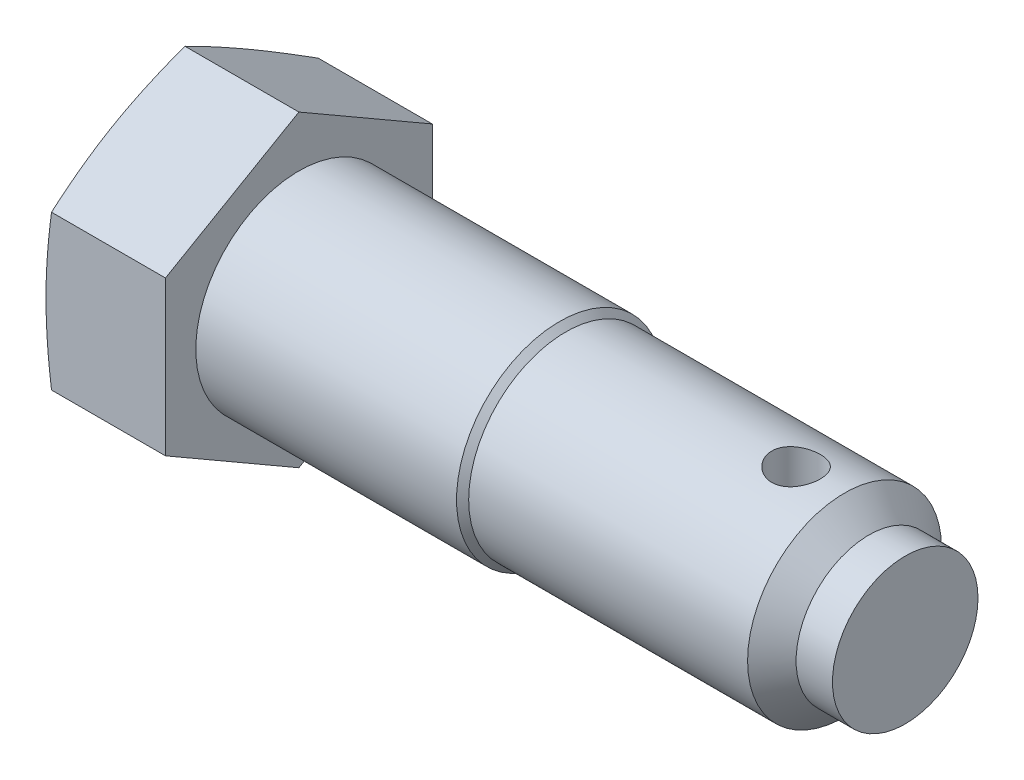
ISO-10303-21;
HEADER;
FILE_DESCRIPTION(('STEP AP214'),'2;1');
FILE_NAME('part.step','',(''),(''),'','','');
FILE_SCHEMA(('AUTOMOTIVE_DESIGN { 1 0 10303 214 1 1 1 1 }'));
ENDSEC;
DATA;
#1=APPLICATION_CONTEXT('core data for automotive mechanical design processes');
#2=APPLICATION_PROTOCOL_DEFINITION('international standard','automotive_design',2000,#1);
#3=PRODUCT_CONTEXT('',#1,'mechanical');
#4=PRODUCT('Part','Part','',(#3));
#5=PRODUCT_RELATED_PRODUCT_CATEGORY('part','',(#4));
#6=PRODUCT_DEFINITION_FORMATION('','',#4);
#7=PRODUCT_DEFINITION_CONTEXT('part definition',#1,'design');
#8=PRODUCT_DEFINITION('design','',#6,#7);
#9=PRODUCT_DEFINITION_SHAPE('','',#8);
#10=(LENGTH_UNIT() NAMED_UNIT(*) SI_UNIT(.MILLI.,.METRE.));
#11=(NAMED_UNIT(*) PLANE_ANGLE_UNIT() SI_UNIT($,.RADIAN.));
#12=(NAMED_UNIT(*) SI_UNIT($,.STERADIAN.) SOLID_ANGLE_UNIT());
#13=UNCERTAINTY_MEASURE_WITH_UNIT(LENGTH_MEASURE(1.E-05),#10,'distance_accuracy_value','');
#14=(GEOMETRIC_REPRESENTATION_CONTEXT(3) GLOBAL_UNCERTAINTY_ASSIGNED_CONTEXT((#13)) GLOBAL_UNIT_ASSIGNED_CONTEXT((#10,
#11,#12)) REPRESENTATION_CONTEXT('',''));
#15=CARTESIAN_POINT('',(0.,0.,0.));
#16=DIRECTION('',(0.,0.,1.));
#17=DIRECTION('',(1.,0.,0.));
#18=AXIS2_PLACEMENT_3D('',#15,#16,#17);
#19=CARTESIAN_POINT('',(0.,0.,0.));
#20=DIRECTION('',(1.,0.,0.));
#21=DIRECTION('',(0.,0.,-1.));
#22=AXIS2_PLACEMENT_3D('',#19,#20,#21);
#23=CYLINDRICAL_SURFACE('',#22,8.5);
#24=CARTESIAN_POINT('',(0.,0.,0.));
#25=DIRECTION('',(1.,0.,0.));
#26=DIRECTION('',(0.,0.,-1.));
#27=AXIS2_PLACEMENT_3D('',#24,#25,#26);
#28=CIRCLE('',#27,8.5);
#29=CARTESIAN_POINT('',(0.,0.,-8.5));
#30=VERTEX_POINT('',#29);
#31=EDGE_CURVE('E115',#30,#30,#28,.F.);
#32=ORIENTED_EDGE('',*,*,#31,.F.);
#33=EDGE_LOOP('',(#32));
#34=FACE_BOUND('',#33,.T.);
#35=CARTESIAN_POINT('',(21.5,0.,0.));
#36=DIRECTION('',(1.,0.,0.));
#37=DIRECTION('',(0.,0.,-1.));
#38=AXIS2_PLACEMENT_3D('',#35,#36,#37);
#39=CIRCLE('',#38,8.5);
#40=CARTESIAN_POINT('',(21.5,0.,-8.5));
#41=VERTEX_POINT('',#40);
#42=EDGE_CURVE('E11',#41,#41,#39,.T.);
#43=ORIENTED_EDGE('',*,*,#42,.F.);
#44=EDGE_LOOP('',(#43));
#45=FACE_BOUND('',#44,.T.);
#46=ADVANCED_FACE('F32',(#34,#45),#23,.T.);
#47=CARTESIAN_POINT('',(22.,0.,0.));
#48=DIRECTION('',(-1.,0.,0.));
#49=DIRECTION('',(0.,0.,1.));
#50=AXIS2_PLACEMENT_3D('',#47,#48,#49);
#51=CONICAL_SURFACE('',#50,8.,0.785398163397452);
#52=ORIENTED_EDGE('',*,*,#42,.T.);
#53=EDGE_LOOP('',(#52));
#54=FACE_BOUND('',#53,.T.);
#55=CARTESIAN_POINT('',(22.,0.,0.));
#56=DIRECTION('',(1.,0.,0.));
#57=DIRECTION('',(0.,0.,-1.));
#58=AXIS2_PLACEMENT_3D('',#55,#56,#57);
#59=CIRCLE('',#58,8.);
#60=CARTESIAN_POINT('',(22.,0.,-8.));
#61=VERTEX_POINT('',#60);
#62=EDGE_CURVE('E44',#61,#61,#59,.T.);
#63=ORIENTED_EDGE('',*,*,#62,.F.);
#64=EDGE_LOOP('',(#63));
#65=FACE_BOUND('',#64,.T.);
#66=ADVANCED_FACE('F209',(#54,#65),#51,.T.);
#67=CARTESIAN_POINT('',(0.,0.,0.));
#68=DIRECTION('',(1.,0.,0.));
#69=DIRECTION('',(0.,0.,-1.));
#70=AXIS2_PLACEMENT_3D('',#67,#68,#69);
#71=CYLINDRICAL_SURFACE('',#70,8.);
#72=CARTESIAN_POINT('',(41.,-7.74596669241484,2.));
#73=CARTESIAN_POINT('',(40.8895593992587,-7.74596880070288,1.99999686287446));
#74=CARTESIAN_POINT('',(40.7790840810572,-7.74835444811678,1.99082099639812));
#75=CARTESIAN_POINT('',(40.5613059374612,-7.75761489594051,1.95441850037104));
#76=CARTESIAN_POINT('',(40.4540049964255,-7.76449230897304,1.92718136539369));
#77=CARTESIAN_POINT('',(40.2457571694503,-7.7819097967692,1.85559295970564));
#78=CARTESIAN_POINT('',(40.1448022756914,-7.79244514152366,1.8112637822836));
#79=CARTESIAN_POINT('',(39.9517513179681,-7.81598553623007,1.70681691300911));
#80=CARTESIAN_POINT('',(39.8596556303358,-7.82899069102792,1.64669855084855));
#81=CARTESIAN_POINT('',(39.6849106837902,-7.856325730845,1.51096674184951));
#82=CARTESIAN_POINT('',(39.60248511972,-7.87067678098427,1.43506951016325));
#83=CARTESIAN_POINT('',(39.4513908845117,-7.89890300412235,1.27054565128054));
#84=CARTESIAN_POINT('',(39.3827234995026,-7.91277813253111,1.18191783534425));
#85=CARTESIAN_POINT('',(39.260179625895,-7.93872332416466,0.992916160863168));
#86=CARTESIAN_POINT('',(39.2065228894708,-7.95076549920474,0.892395660956099));
#87=CARTESIAN_POINT('',(39.1169522846775,-7.97144649540787,0.683410547434211));
#88=CARTESIAN_POINT('',(39.0810357984676,-7.98008581867476,0.574947108633554));
#89=CARTESIAN_POINT('',(39.0286817323371,-7.99283807078545,0.355487007003331));
#90=CARTESIAN_POINT('',(39.0118642845387,-7.99703915075452,0.244586175639183));
#91=CARTESIAN_POINT('',(38.9969932965796,-8.00074875285839,0.021463055410218));
#92=CARTESIAN_POINT('',(38.9989369822323,-8.00025796877364,-0.0907590356304527));
#93=CARTESIAN_POINT('',(39.0212598802001,-7.99470475962828,-0.310704494344772));
#94=CARTESIAN_POINT('',(39.0412290600431,-7.989744018727,-0.418472431202131));
#95=CARTESIAN_POINT('',(39.0983770160388,-7.97592669219884,-0.62907649482737));
#96=CARTESIAN_POINT('',(39.1355567083019,-7.96706989918753,-0.731912358740875));
#97=CARTESIAN_POINT('',(39.2264020565497,-7.94630007760717,-0.930813407003614));
#98=CARTESIAN_POINT('',(39.2802136357294,-7.93436015756043,-1.02680901953301));
#99=CARTESIAN_POINT('',(39.402684543293,-7.9087192304772,-1.20855124468098));
#100=CARTESIAN_POINT('',(39.4713464548485,-7.89501791721992,-1.29429607017101));
#101=CARTESIAN_POINT('',(39.6237669935859,-7.86690971015617,-1.45554807016992));
#102=CARTESIAN_POINT('',(39.7078839138782,-7.85249375620734,-1.5307153581504));
#103=CARTESIAN_POINT('',(39.8876799788322,-7.82492034813365,-1.66595275192604));
#104=CARTESIAN_POINT('',(39.9833596635928,-7.81176295284777,-1.72602215209203));
#105=CARTESIAN_POINT('',(40.1842320273192,-7.78816397465319,-1.8295762580452));
#106=CARTESIAN_POINT('',(40.2894685842506,-7.77773586980577,-1.87297913394099));
#107=CARTESIAN_POINT('',(40.5060683744612,-7.76094912111966,-1.94137124127268));
#108=CARTESIAN_POINT('',(40.6174302911865,-7.75458960648175,-1.96636441310582));
#109=CARTESIAN_POINT('',(40.8399676012185,-7.74684284831313,-1.99666371093214));
#110=CARTESIAN_POINT('',(40.9510702346637,-7.74532871274919,-2.0024723791357));
#111=CARTESIAN_POINT('',(41.1726575492625,-7.74709874784832,-1.99561359241244));
#112=CARTESIAN_POINT('',(41.283142286361,-7.75038247681013,-1.98294783827904));
#113=CARTESIAN_POINT('',(41.4984914119638,-7.76125665563649,-1.93994037115013));
#114=CARTESIAN_POINT('',(41.6034181812567,-7.768775761875,-1.9098912546254));
#115=CARTESIAN_POINT('',(41.8067451662814,-7.7872057461677,-1.8332944653365));
#116=CARTESIAN_POINT('',(41.9051446072443,-7.79811702598891,-1.78674483817004));
#117=CARTESIAN_POINT('',(42.0947530222939,-7.8223690967461,-1.67741653434925));
#118=CARTESIAN_POINT('',(42.1857830720345,-7.83575334885314,-1.6143374030685));
#119=CARTESIAN_POINT('',(42.3561506902411,-7.86333666457373,-1.47412058586891));
#120=CARTESIAN_POINT('',(42.4354863333201,-7.87753586182777,-1.39698058961088));
#121=CARTESIAN_POINT('',(42.5822488340568,-7.90557922425285,-1.22852544196945));
#122=CARTESIAN_POINT('',(42.6493280500391,-7.91940561649469,-1.13690390506319));
#123=CARTESIAN_POINT('',(42.767148693561,-7.94477773290988,-0.943405365389351));
#124=CARTESIAN_POINT('',(42.8178909732866,-7.95632357603169,-0.841528897915182));
#125=CARTESIAN_POINT('',(42.9011568276224,-7.97576092590651,-0.63111640346218));
#126=CARTESIAN_POINT('',(42.9338114275033,-7.98367864017925,-0.522634762055763));
#127=CARTESIAN_POINT('',(42.9803682676867,-7.99508234716634,-0.301499520637612));
#128=CARTESIAN_POINT('',(42.9942741269912,-7.99856919514738,-0.188846730082479));
#129=CARTESIAN_POINT('',(43.0027351791511,-8.00068338817612,0.0341670528866484));
#130=CARTESIAN_POINT('',(42.9978034181908,-7.99943957759977,0.144507653932046));
#131=CARTESIAN_POINT('',(42.9699043454113,-7.99251792914887,0.362734992829505));
#132=CARTESIAN_POINT('',(42.9469375699737,-7.98684022314338,0.47062180356186));
#133=CARTESIAN_POINT('',(42.8838955604583,-7.97170865707779,0.680342071289551));
#134=CARTESIAN_POINT('',(42.8439130933712,-7.96227529004785,0.782204989161728));
#135=CARTESIAN_POINT('',(42.7480588419609,-7.94062577827316,0.977834106083251));
#136=CARTESIAN_POINT('',(42.692185054659,-7.92840928277515,1.07159928253127));
#137=CARTESIAN_POINT('',(42.5645695320077,-7.90214499360574,1.25080385684661));
#138=CARTESIAN_POINT('',(42.4924797141923,-7.88806033883329,1.33598997659668));
#139=CARTESIAN_POINT('',(42.3351542960453,-7.8598129811438,1.49323004054701));
#140=CARTESIAN_POINT('',(42.2499153677777,-7.84565025934605,1.56528065015318));
#141=CARTESIAN_POINT('',(42.0667971716211,-7.81854951691005,1.69552405294367));
#142=CARTESIAN_POINT('',(41.9687117532695,-7.80563927346578,1.75343323883276));
#143=CARTESIAN_POINT('',(41.7638890202504,-7.78287910989656,1.85185379317095));
#144=CARTESIAN_POINT('',(41.6571580678123,-7.77302696466428,1.89237781950431));
#145=CARTESIAN_POINT('',(41.4588459763297,-7.75903817501475,1.94884505714201));
#146=CARTESIAN_POINT('',(41.3682136712277,-7.75417326006998,1.96798634119376));
#147=CARTESIAN_POINT('',(41.1850622620046,-7.74763677165241,1.99356458514354));
#148=CARTESIAN_POINT('',(41.0925433195112,-7.74596492578216,2.00000262874351));
#149=CARTESIAN_POINT('',(41.,-7.74596669241484,2.));
#150=B_SPLINE_CURVE_WITH_KNOTS('',3,(#72,#73,#74,#75,#76,#77,#78,#79,#80,#81,#82,#83,#84,#85,
#86,#87,#88,#89,#90,#91,#92,#93,#94,#95,#96,#97,#98,#99,#100,#101,#102,#103,#104,#105,#106,#107,
#108,#109,#110,#111,#112,#113,#114,#115,#116,#117,#118,#119,#120,#121,#122,#123,#124,#125,#126,
#127,#128,#129,#130,#131,#132,#133,#134,#135,#136,#137,#138,#139,#140,#141,#142,#143,#144,#145,
#146,#147,#148,#149),.UNSPECIFIED.,.T.,.F.,(4,2,2,2,2,2,2,2,2,2,2,2,2,2,2,2,2,2,2,2,2,2,2,2,2,2,
2,2,2,2,2,2,2,2,2,2,2,2,4),(0.,0.330981953388917,0.662156593142934,0.992904581732817,
1.32366661404383,1.6609916335438,1.99834817183894,2.34041197118337,2.68242527877674,
3.01751000796278,3.35254518932817,3.68014610151158,4.0077644537983,4.33834299403557,
4.66897908375132,5.00856373257531,5.34816424959843,5.68941145606724,6.03058560103639,
6.36274859809376,6.69488101747043,7.02157924007367,7.34831617137135,7.68146276687327,
8.01466415108037,8.35620264772256,8.69772332575644,9.03673658245545,9.37568439127232,
9.70546756901967,10.0352409390159,10.3632390124777,10.6912784459046,11.0271767726566,
11.3631602525241,11.7054118182895,12.0474137709606,12.3247826174463,12.6021278008238),.UNSPECIFIED.);
#151=CARTESIAN_POINT('',(41.,-7.74596669241484,2.));
#152=VERTEX_POINT('',#151);
#153=EDGE_CURVE('E35',#152,#152,#150,.T.);
#154=ORIENTED_EDGE('',*,*,#153,.F.);
#155=EDGE_LOOP('',(#154));
#156=FACE_BOUND('',#155,.T.);
#157=CARTESIAN_POINT('',(41.,7.74596669241484,2.));
#158=CARTESIAN_POINT('',(41.1104406007413,7.74596880070288,1.99999686287446));
#159=CARTESIAN_POINT('',(41.2209159189428,7.74835444811678,1.99082099639812));
#160=CARTESIAN_POINT('',(41.4386940625388,7.75761489594051,1.95441850037104));
#161=CARTESIAN_POINT('',(41.5459950035746,7.76449230897304,1.92718136539369));
#162=CARTESIAN_POINT('',(41.7542428305497,7.7819097967692,1.85559295970564));
#163=CARTESIAN_POINT('',(41.8551977243086,7.79244514152366,1.8112637822836));
#164=CARTESIAN_POINT('',(42.0482486820319,7.81598553623007,1.70681691300911));
#165=CARTESIAN_POINT('',(42.1403443696642,7.82899069102792,1.64669855084855));
#166=CARTESIAN_POINT('',(42.3150893162098,7.856325730845,1.51096674184951));
#167=CARTESIAN_POINT('',(42.39751488028,7.87067678098428,1.43506951016324));
#168=CARTESIAN_POINT('',(42.5486091154883,7.89890300412235,1.27054565128053));
#169=CARTESIAN_POINT('',(42.6172765004974,7.91277813253111,1.18191783534425));
#170=CARTESIAN_POINT('',(42.739820374105,7.93872332416466,0.992916160863167));
#171=CARTESIAN_POINT('',(42.7934771105292,7.95076549920474,0.892395660956099));
#172=CARTESIAN_POINT('',(42.8830477153225,7.97144649540787,0.683410547434211));
#173=CARTESIAN_POINT('',(42.9189642015324,7.98008581867476,0.574947108633554));
#174=CARTESIAN_POINT('',(42.9713182676629,7.99283807078545,0.355487007003331));
#175=CARTESIAN_POINT('',(42.9881357154613,7.99703915075452,0.244586175639183));
#176=CARTESIAN_POINT('',(43.0030067034205,8.00074875285839,0.021463055410218));
#177=CARTESIAN_POINT('',(43.0010630177677,8.00025796877364,-0.0907590356304527));
#178=CARTESIAN_POINT('',(42.9787401197999,7.99470475962828,-0.310704494344773));
#179=CARTESIAN_POINT('',(42.9587709399569,7.989744018727,-0.418472431202132));
#180=CARTESIAN_POINT('',(42.9016229839612,7.97592669219884,-0.629076494827372));
#181=CARTESIAN_POINT('',(42.8644432916981,7.96706989918753,-0.731912358740876));
#182=CARTESIAN_POINT('',(42.7735979434503,7.94630007760717,-0.930813407003614));
#183=CARTESIAN_POINT('',(42.7197863642706,7.93436015756043,-1.02680901953301));
#184=CARTESIAN_POINT('',(42.597315456707,7.9087192304772,-1.20855124468098));
#185=CARTESIAN_POINT('',(42.5286535451515,7.89501791721992,-1.29429607017101));
#186=CARTESIAN_POINT('',(42.3762330064141,7.86690971015617,-1.45554807016991));
#187=CARTESIAN_POINT('',(42.2921160861218,7.85249375620735,-1.5307153581504));
#188=CARTESIAN_POINT('',(42.1123200211678,7.82492034813365,-1.66595275192604));
#189=CARTESIAN_POINT('',(42.0166403364072,7.81176295284777,-1.72602215209203));
#190=CARTESIAN_POINT('',(41.8157679726808,7.78816397465319,-1.82957625804519));
#191=CARTESIAN_POINT('',(41.7105314157495,7.77773586980577,-1.87297913394098));
#192=CARTESIAN_POINT('',(41.4939316255388,7.76094912111966,-1.94137124127268));
#193=CARTESIAN_POINT('',(41.3825697088135,7.75458960648175,-1.96636441310582));
#194=CARTESIAN_POINT('',(41.1600323987815,7.74684284831313,-1.99666371093214));
#195=CARTESIAN_POINT('',(41.0489297653363,7.74532871274919,-2.0024723791357));
#196=CARTESIAN_POINT('',(40.8273424507375,7.74709874784832,-1.99561359241244));
#197=CARTESIAN_POINT('',(40.716857713639,7.75038247681013,-1.98294783827904));
#198=CARTESIAN_POINT('',(40.5015085880362,7.76125665563649,-1.93994037115013));
#199=CARTESIAN_POINT('',(40.3965818187433,7.768775761875,-1.9098912546254));
#200=CARTESIAN_POINT('',(40.1932548337187,7.7872057461677,-1.8332944653365));
#201=CARTESIAN_POINT('',(40.0948553927557,7.79811702598891,-1.78674483817004));
#202=CARTESIAN_POINT('',(39.9052469777061,7.8223690967461,-1.67741653434925));
#203=CARTESIAN_POINT('',(39.8142169279655,7.83575334885314,-1.6143374030685));
#204=CARTESIAN_POINT('',(39.6438493097589,7.86333666457373,-1.47412058586891));
#205=CARTESIAN_POINT('',(39.5645136666799,7.87753586182777,-1.39698058961088));
#206=CARTESIAN_POINT('',(39.4177511659432,7.90557922425285,-1.22852544196945));
#207=CARTESIAN_POINT('',(39.350671949961,7.91940561649469,-1.13690390506319));
#208=CARTESIAN_POINT('',(39.232851306439,7.94477773290988,-0.943405365389356));
#209=CARTESIAN_POINT('',(39.1821090267134,7.95632357603169,-0.841528897915184));
#210=CARTESIAN_POINT('',(39.0988431723777,7.97576092590651,-0.63111640346218));
#211=CARTESIAN_POINT('',(39.0661885724968,7.98367864017925,-0.522634762055764));
#212=CARTESIAN_POINT('',(39.0196317323133,7.99508234716634,-0.301499520637613));
#213=CARTESIAN_POINT('',(39.0057258730088,7.99856919514738,-0.18884673008248));
#214=CARTESIAN_POINT('',(38.9972648208489,8.00068338817612,0.0341670528866484));
#215=CARTESIAN_POINT('',(39.0021965818092,7.99943957759977,0.144507653932046));
#216=CARTESIAN_POINT('',(39.0300956545887,7.99251792914887,0.362734992829505));
#217=CARTESIAN_POINT('',(39.0530624300263,7.98684022314338,0.47062180356186));
#218=CARTESIAN_POINT('',(39.1161044395417,7.97170865707779,0.680342071289551));
#219=CARTESIAN_POINT('',(39.1560869066288,7.96227529004785,0.782204989161728));
#220=CARTESIAN_POINT('',(39.2519411580391,7.94062577827316,0.977834106083251));
#221=CARTESIAN_POINT('',(39.307814945341,7.92840928277515,1.07159928253127));
#222=CARTESIAN_POINT('',(39.4354304679923,7.90214499360574,1.25080385684661));
#223=CARTESIAN_POINT('',(39.5075202858077,7.88806033883329,1.33598997659668));
#224=CARTESIAN_POINT('',(39.6648457039547,7.8598129811438,1.49323004054701));
#225=CARTESIAN_POINT('',(39.7500846322223,7.84565025934605,1.56528065015318));
#226=CARTESIAN_POINT('',(39.9332028283789,7.81854951691005,1.69552405294367));
#227=CARTESIAN_POINT('',(40.0312882467305,7.80563927346578,1.75343323883276));
#228=CARTESIAN_POINT('',(40.2361109797496,7.78287910989656,1.85185379317095));
#229=CARTESIAN_POINT('',(40.3428419321877,7.77302696466428,1.89237781950431));
#230=CARTESIAN_POINT('',(40.5411540236703,7.75903817501475,1.94884505714201));
#231=CARTESIAN_POINT('',(40.6317863287723,7.75417326006998,1.96798634119376));
#232=CARTESIAN_POINT('',(40.8149377379954,7.74763677165241,1.99356458514354));
#233=CARTESIAN_POINT('',(40.9074566804888,7.74596492578216,2.00000262874351));
#234=CARTESIAN_POINT('',(41.,7.74596669241484,2.));
#235=B_SPLINE_CURVE_WITH_KNOTS('',3,(#157,#158,#159,#160,#161,#162,#163,#164,#165,#166,#167,
#168,#169,#170,#171,#172,#173,#174,#175,#176,#177,#178,#179,#180,#181,#182,#183,#184,#185,#186,
#187,#188,#189,#190,#191,#192,#193,#194,#195,#196,#197,#198,#199,#200,#201,#202,#203,#204,#205,
#206,#207,#208,#209,#210,#211,#212,#213,#214,#215,#216,#217,#218,#219,#220,#221,#222,#223,#224,
#225,#226,#227,#228,#229,#230,#231,#232,#233,#234),.UNSPECIFIED.,.T.,.F.,(4,2,2,2,2,2,2,2,2,2,2,
2,2,2,2,2,2,2,2,2,2,2,2,2,2,2,2,2,2,2,2,2,2,2,2,2,2,2,4),(0.,0.330981953388917,
0.662156593142934,0.992904581732817,1.32366661404383,1.66099163354382,1.99834817183894,
2.34041197118337,2.68242527877674,3.01751000796278,3.35254518932817,3.68014610151158,
4.0077644537983,4.33834299403557,4.66897908375132,5.0085637325753,5.34816424959843,
5.68941145606723,6.03058560103639,6.36274859809376,6.69488101747044,7.02157924007367,
7.34831617137135,7.68146276687327,8.01466415108037,8.35620264772256,8.69772332575644,
9.03673658245545,9.37568439127232,9.70546756901967,10.0352409390159,10.3632390124777,
10.6912784459046,11.0271767726566,11.3631602525241,11.7054118182895,12.0474137709606,
12.3247826174463,12.6021278008238),.UNSPECIFIED.);
#236=CARTESIAN_POINT('',(41.,7.74596669241484,2.));
#237=VERTEX_POINT('',#236);
#238=EDGE_CURVE('E133',#237,#237,#235,.T.);
#239=ORIENTED_EDGE('',*,*,#238,.F.);
#240=EDGE_LOOP('',(#239));
#241=FACE_BOUND('',#240,.T.);
#242=ORIENTED_EDGE('',*,*,#62,.T.);
#243=EDGE_LOOP('',(#242));
#244=FACE_BOUND('',#243,.T.);
#245=CARTESIAN_POINT('',(45.,0.,0.));
#246=DIRECTION('',(1.,0.,0.));
#247=DIRECTION('',(0.,0.,-1.));
#248=AXIS2_PLACEMENT_3D('',#245,#246,#247);
#249=CIRCLE('',#248,8.);
#250=CARTESIAN_POINT('',(45.,0.,-8.));
#251=VERTEX_POINT('',#250);
#252=EDGE_CURVE('E129',#251,#251,#249,.T.);
#253=ORIENTED_EDGE('',*,*,#252,.F.);
#254=EDGE_LOOP('',(#253));
#255=FACE_BOUND('',#254,.T.);
#256=ADVANCED_FACE('F137',(#156,#241,#244,#255),#71,.T.);
#257=CARTESIAN_POINT('',(47.,0.,0.));
#258=DIRECTION('',(-1.,0.,0.));
#259=DIRECTION('',(0.,0.,1.));
#260=AXIS2_PLACEMENT_3D('',#257,#258,#259);
#261=CONICAL_SURFACE('',#260,6.00000000000001,0.78539816339745);
#262=ORIENTED_EDGE('',*,*,#252,.T.);
#263=EDGE_LOOP('',(#262));
#264=FACE_BOUND('',#263,.T.);
#265=CARTESIAN_POINT('',(47.,0.,0.));
#266=DIRECTION('',(1.,0.,0.));
#267=DIRECTION('',(0.,0.,-1.));
#268=AXIS2_PLACEMENT_3D('',#265,#266,#267);
#269=CIRCLE('',#268,6.00000000000001);
#270=CARTESIAN_POINT('',(47.,0.,-6.00000000000001));
#271=VERTEX_POINT('',#270);
#272=EDGE_CURVE('E126',#271,#271,#269,.T.);
#273=ORIENTED_EDGE('',*,*,#272,.F.);
#274=EDGE_LOOP('',(#273));
#275=FACE_BOUND('',#274,.T.);
#276=ADVANCED_FACE('F202',(#264,#275),#261,.T.);
#277=CARTESIAN_POINT('',(0.,0.,0.));
#278=DIRECTION('',(1.,0.,0.));
#279=DIRECTION('',(0.,0.,-1.));
#280=AXIS2_PLACEMENT_3D('',#277,#278,#279);
#281=CYLINDRICAL_SURFACE('',#280,6.00000000000001);
#282=ORIENTED_EDGE('',*,*,#272,.T.);
#283=EDGE_LOOP('',(#282));
#284=FACE_BOUND('',#283,.T.);
#285=CARTESIAN_POINT('',(50.,0.,0.));
#286=DIRECTION('',(1.,0.,0.));
#287=DIRECTION('',(0.,0.,-1.));
#288=AXIS2_PLACEMENT_3D('',#285,#286,#287);
#289=CIRCLE('',#288,6.00000000000001);
#290=CARTESIAN_POINT('',(50.,0.,-6.00000000000001));
#291=VERTEX_POINT('',#290);
#292=EDGE_CURVE('E123',#291,#291,#289,.T.);
#293=ORIENTED_EDGE('',*,*,#292,.F.);
#294=EDGE_LOOP('',(#293));
#295=FACE_BOUND('',#294,.T.);
#296=ADVANCED_FACE('F199',(#284,#295),#281,.T.);
#297=CARTESIAN_POINT('',(50.,6.00000000000001,0.));
#298=DIRECTION('',(1.,0.,0.));
#299=DIRECTION('',(0.,0.,-1.));
#300=AXIS2_PLACEMENT_3D('',#297,#298,#299);
#301=PLANE('',#300);
#302=ORIENTED_EDGE('',*,*,#292,.T.);
#303=EDGE_LOOP('',(#302));
#304=FACE_BOUND('',#303,.T.);
#305=ADVANCED_FACE('F196',(#304),#301,.T.);
#306=CARTESIAN_POINT('',(-10.,6.35085296108589,11.));
#307=DIRECTION('',(0.,-0.866025403784439,-0.5));
#308=DIRECTION('',(0.,0.5,-0.866025403784439));
#309=AXIS2_PLACEMENT_3D('',#306,#307,#308);
#310=PLANE('',#309);
#311=DIRECTION('',(1.,0.,0.));
#312=VECTOR('',#311,1.);
#313=CARTESIAN_POINT('',(-10.,12.7017059221718,0.));
#314=LINE('',#313,#312);
#315=CARTESIAN_POINT('',(-9.39665721656171,12.7017059221718,0.));
#316=VERTEX_POINT('',#315);
#317=CARTESIAN_POINT('',(0.,12.7017059221718,0.));
#318=VERTEX_POINT('',#317);
#319=EDGE_CURVE('E113',#316,#318,#314,.T.);
#320=ORIENTED_EDGE('',*,*,#319,.F.);
#321=CARTESIAN_POINT('',(-9.39662627603213,12.7018213922256,-0.000199999999997409));
#322=CARTESIAN_POINT('',(-9.46732508481653,12.4380768419232,0.45661896134321));
#323=CARTESIAN_POINT('',(-9.53150785884367,12.1738541031355,0.914266169438542));
#324=CARTESIAN_POINT('',(-9.64427088043107,11.644475533245,1.83117674892698));
#325=CARTESIAN_POINT('',(-9.69284479100576,11.3793193672375,2.29044070039205));
#326=CARTESIAN_POINT('',(-9.77155445851667,10.8496815308214,3.2078003426756));
#327=CARTESIAN_POINT('',(-9.80178407701208,10.5852034415666,3.66588983075379));
#328=CARTESIAN_POINT('',(-9.84231889252227,10.0559099986362,4.58265296602219));
#329=CARTESIAN_POINT('',(-9.85262794416288,9.79109472013253,5.0413264830111));
#330=CARTESIAN_POINT('',(-9.85262794416288,9.26146416312513,5.9586735169889));
#331=CARTESIAN_POINT('',(-9.84231889252227,8.99664888462144,6.4173470339778));
#332=CARTESIAN_POINT('',(-9.80178407701208,8.4673554416911,7.3341101692462));
#333=CARTESIAN_POINT('',(-9.77155445851667,8.20287735243622,7.7921996573244));
#334=CARTESIAN_POINT('',(-9.69284479100576,7.67323951602012,8.70955929960795));
#335=CARTESIAN_POINT('',(-9.64427088043107,7.40808335001267,9.16882325107301));
#336=CARTESIAN_POINT('',(-9.53150785884367,6.8787047801222,10.0857338305615));
#337=CARTESIAN_POINT('',(-9.46732508481653,6.61448204133448,10.5433810386568));
#338=CARTESIAN_POINT('',(-9.39662627603213,6.35073749103205,11.0002));
#339=B_SPLINE_CURVE_WITH_KNOTS('',3,(#321,#322,#323,#324,#325,#326,#327,#328,#329,#330,#331,
#332,#333,#334,#335,#336,#337,#338),.UNSPECIFIED.,.F.,.F.,(4,2,2,2,2,2,2,2,4),(0.,
1.59670121511687,3.19404985254325,4.78315492460559,6.37195247434001,7.96075002407443,
9.54985509613678,11.1472037335631,12.74390494868),.UNSPECIFIED.);
#340=CARTESIAN_POINT('',(-9.39665721656171,6.3508529610859,11.));
#341=VERTEX_POINT('',#340);
#342=EDGE_CURVE('E95',#316,#341,#339,.T.);
#343=ORIENTED_EDGE('',*,*,#342,.T.);
#344=DIRECTION('',(1.,0.,0.));
#345=VECTOR('',#344,1.);
#346=CARTESIAN_POINT('',(-10.,6.35085296108589,11.));
#347=LINE('',#346,#345);
#348=CARTESIAN_POINT('',(0.,6.35085296108589,11.));
#349=VERTEX_POINT('',#348);
#350=EDGE_CURVE('E60',#341,#349,#347,.T.);
#351=ORIENTED_EDGE('',*,*,#350,.T.);
#352=DIRECTION('',(0.,0.5,-0.866025403784439));
#353=VECTOR('',#352,1.);
#354=CARTESIAN_POINT('',(0.,6.35085296108589,11.));
#355=LINE('',#354,#353);
#356=EDGE_CURVE('E232',#349,#318,#355,.T.);
#357=ORIENTED_EDGE('',*,*,#356,.T.);
#358=EDGE_LOOP('',(#320,#343,#351,#357));
#359=FACE_BOUND('',#358,.T.);
#360=ADVANCED_FACE('F191',(#359),#310,.F.);
#361=CARTESIAN_POINT('',(-10.,12.7017059221718,0.));
#362=DIRECTION('',(0.,-0.866025403784439,0.5));
#363=DIRECTION('',(0.,-0.5,-0.866025403784439));
#364=AXIS2_PLACEMENT_3D('',#361,#362,#363);
#365=PLANE('',#364);
#366=DIRECTION('',(1.,0.,0.));
#367=VECTOR('',#366,1.);
#368=CARTESIAN_POINT('',(-10.,6.35085296108589,-11.));
#369=LINE('',#368,#367);
#370=CARTESIAN_POINT('',(-9.39665721656171,6.35085296108589,-11.));
#371=VERTEX_POINT('',#370);
#372=CARTESIAN_POINT('',(0.,6.35085296108589,-11.));
#373=VERTEX_POINT('',#372);
#374=EDGE_CURVE('E104',#371,#373,#369,.T.);
#375=ORIENTED_EDGE('',*,*,#374,.F.);
#376=CARTESIAN_POINT('',(-9.39662627603213,6.35073749103205,-11.0002));
#377=CARTESIAN_POINT('',(-9.46732508481653,6.61448204133447,-10.5433810386568));
#378=CARTESIAN_POINT('',(-9.53150785884367,6.8787047801222,-10.0857338305615));
#379=CARTESIAN_POINT('',(-9.64427088043107,7.40808335001266,-9.16882325107302));
#380=CARTESIAN_POINT('',(-9.69284479100576,7.67323951602011,-8.70955929960795));
#381=CARTESIAN_POINT('',(-9.77155445851667,8.20287735243622,-7.7921996573244));
#382=CARTESIAN_POINT('',(-9.80178407701208,8.4673554416911,-7.33411016924621));
#383=CARTESIAN_POINT('',(-9.84231889252227,8.99664888462144,-6.4173470339778));
#384=CARTESIAN_POINT('',(-9.85262794416289,9.26146416312513,-5.9586735169889));
#385=CARTESIAN_POINT('',(-9.85262794416289,9.79109472013252,-5.0413264830111));
#386=CARTESIAN_POINT('',(-9.84231889252227,10.0559099986362,-4.58265296602219));
#387=CARTESIAN_POINT('',(-9.80178407701208,10.5852034415666,-3.66588983075379));
#388=CARTESIAN_POINT('',(-9.77155445851667,10.8496815308214,-3.2078003426756));
#389=CARTESIAN_POINT('',(-9.69284479100576,11.3793193672375,-2.29044070039205));
#390=CARTESIAN_POINT('',(-9.64427088043107,11.644475533245,-1.83117674892698));
#391=CARTESIAN_POINT('',(-9.53150785884367,12.1738541031355,-0.914266169438537));
#392=CARTESIAN_POINT('',(-9.46732508481653,12.4380768419232,-0.456618961343205));
#393=CARTESIAN_POINT('',(-9.39662627603213,12.7018213922256,0.000200000000003999));
#394=B_SPLINE_CURVE_WITH_KNOTS('',3,(#376,#377,#378,#379,#380,#381,#382,#383,#384,#385,#386,
#387,#388,#389,#390,#391,#392,#393),.UNSPECIFIED.,.F.,.F.,(4,2,2,2,2,2,2,2,4),(0.,
1.59670121511688,3.19404985254326,4.7831549246056,6.37195247434002,7.96075002407444,
9.54985509613679,11.1472037335632,12.74390494868),.UNSPECIFIED.);
#395=EDGE_CURVE('E90',#371,#316,#394,.T.);
#396=ORIENTED_EDGE('',*,*,#395,.T.);
#397=ORIENTED_EDGE('',*,*,#319,.T.);
#398=DIRECTION('',(0.,-0.5,-0.866025403784439));
#399=VECTOR('',#398,1.);
#400=CARTESIAN_POINT('',(0.,12.7017059221718,0.));
#401=LINE('',#400,#399);
#402=EDGE_CURVE('E111',#318,#373,#401,.T.);
#403=ORIENTED_EDGE('',*,*,#402,.T.);
#404=EDGE_LOOP('',(#375,#396,#397,#403));
#405=FACE_BOUND('',#404,.T.);
#406=ADVANCED_FACE('F109',(#405),#365,.F.);
#407=CARTESIAN_POINT('',(-10.,6.35085296108589,-11.));
#408=DIRECTION('',(0.,0.,1.));
#409=DIRECTION('',(1.,0.,0.));
#410=AXIS2_PLACEMENT_3D('',#407,#408,#409);
#411=PLANE('',#410);
#412=DIRECTION('',(1.,0.,0.));
#413=VECTOR('',#412,1.);
#414=CARTESIAN_POINT('',(-10.,-6.35085296108588,-11.));
#415=LINE('',#414,#413);
#416=CARTESIAN_POINT('',(-9.39665721656171,-6.35085296108588,-11.));
#417=VERTEX_POINT('',#416);
#418=CARTESIAN_POINT('',(0.,-6.35085296108588,-11.));
#419=VERTEX_POINT('',#418);
#420=EDGE_CURVE('E106',#417,#419,#415,.T.);
#421=ORIENTED_EDGE('',*,*,#420,.F.);
#422=CARTESIAN_POINT('',(-7.42388137262567,-16.7801175951475,-11.));
#423=CARTESIAN_POINT('',(-7.5356309599887,-16.2813050169155,-11.));
#424=CARTESIAN_POINT('',(-7.64601044346641,-15.7821798837228,-11.));
#425=CARTESIAN_POINT('',(-7.86328967734055,-14.7831510497652,-11.));
#426=CARTESIAN_POINT('',(-7.97018927681949,-14.2832473162161,-11.));
#427=CARTESIAN_POINT('',(-8.17986278992948,-13.2820573632576,-11.));
#428=CARTESIAN_POINT('',(-8.28263252908443,-12.7807702664818,-11.));
#429=CARTESIAN_POINT('',(-8.48293380894406,-11.7771512064843,-11.));
#430=CARTESIAN_POINT('',(-8.58046539407493,-11.2748192521619,-11.));
#431=CARTESIAN_POINT('',(-8.76828812506116,-10.2729548841119,-11.));
#432=CARTESIAN_POINT('',(-8.85863093050103,-9.77343220311056,-11.));
#433=CARTESIAN_POINT('',(-9.03140930348365,-8.7730102974347,-11.));
#434=CARTESIAN_POINT('',(-9.11384484158803,-8.27211106764249,-11.));
#435=CARTESIAN_POINT('',(-9.26894465465913,-7.26886039941843,-11.));
#436=CARTESIAN_POINT('',(-9.34161029066016,-6.76650917324339,-11.));
#437=CARTESIAN_POINT('',(-9.47502654326464,-5.76020882790563,-11.));
#438=CARTESIAN_POINT('',(-9.53577714954705,-5.25625970735916,-11.));
#439=CARTESIAN_POINT('',(-9.64363887592661,-4.24108542573291,-11.));
#440=CARTESIAN_POINT('',(-9.6905870438235,-3.72984268995295,-11.));
#441=CARTESIAN_POINT('',(-9.76760233141287,-2.70607634125081,-11.));
#442=CARTESIAN_POINT('',(-9.79766983825824,-2.1935527579753,-11.));
#443=CARTESIAN_POINT('',(-9.83916993693317,-1.16796788455669,-11.));
#444=CARTESIAN_POINT('',(-9.85061093202421,-0.654906941437574,-11.));
#445=CARTESIAN_POINT('',(-9.85415510051156,0.371282758987295,-11.));
#446=CARTESIAN_POINT('',(-9.84625828682822,0.884411516247514,-11.));
#447=CARTESIAN_POINT('',(-9.81157079469443,1.91188968945078,-11.));
#448=CARTESIAN_POINT('',(-9.78471134637838,2.42623673636404,-11.));
#449=CARTESIAN_POINT('',(-9.71362957984439,3.45371853578703,-11.));
#450=CARTESIAN_POINT('',(-9.66940687871218,3.96685326131018,-11.));
#451=CARTESIAN_POINT('',(-9.56582738852392,4.99190696444284,-11.));
#452=CARTESIAN_POINT('',(-9.50646075887166,5.50382493225285,-11.));
#453=CARTESIAN_POINT('',(-9.37505758959837,6.52601412270777,-11.));
#454=CARTESIAN_POINT('',(-9.30302101105935,7.0362853402895,-11.));
#455=CARTESIAN_POINT('',(-9.1536423793593,8.02181092851998,-11.));
#456=CARTESIAN_POINT('',(-9.07695856740143,8.49716608482734,-11.));
#457=CARTESIAN_POINT('',(-8.91616092195143,9.44662421093953,-11.));
#458=CARTESIAN_POINT('',(-8.83204688601822,9.92072714626415,-11.));
#459=CARTESIAN_POINT('',(-8.65774536703929,10.8678590126662,-11.));
#460=CARTESIAN_POINT('',(-8.56755727388029,11.3408878309054,-11.));
#461=CARTESIAN_POINT('',(-8.38222711433411,12.2859660191292,-11.));
#462=CARTESIAN_POINT('',(-8.28708509272075,12.758015397926,-11.));
#463=CARTESIAN_POINT('',(-8.09271933636531,13.7013870399982,-11.));
#464=CARTESIAN_POINT('',(-7.99349464263292,14.1727091051464,-11.));
#465=CARTESIAN_POINT('',(-7.79169487217196,15.1146364979406,-11.));
#466=CARTESIAN_POINT('',(-7.68911977600635,15.5852418214117,-11.));
#467=CARTESIAN_POINT('',(-7.37727307026139,16.9960797223851,-11.));
#468=CARTESIAN_POINT('',(-7.16386672641428,17.9353980180346,-11.));
#469=CARTESIAN_POINT('',(-6.73150792694893,19.8029725067641,-11.));
#470=CARTESIAN_POINT('',(-6.51263107785774,20.7312463182368,-11.));
#471=CARTESIAN_POINT('',(-6.06940222240138,22.5865014284903,-11.));
#472=CARTESIAN_POINT('',(-5.84505011643868,23.5134827034346,-11.));
#473=CARTESIAN_POINT('',(-5.39256994502507,25.365312037806,-11.));
#474=CARTESIAN_POINT('',(-5.16444686797217,26.2901613185028,-11.));
#475=CARTESIAN_POINT('',(-4.81995910729176,27.6768462370108,-11.));
#476=CARTESIAN_POINT('',(-4.70474786579954,28.1389689559575,-11.));
#477=CARTESIAN_POINT('',(-4.47364517344672,29.0630437745837,-11.));
#478=CARTESIAN_POINT('',(-4.35775372331801,29.5249958744463,-11.));
#479=CARTESIAN_POINT('',(-4.24156638787032,29.9868735377545,-11.));
#480=B_SPLINE_CURVE_WITH_KNOTS('',3,(#422,#423,#424,#425,#426,#427,#428,#429,#430,#431,#432,
#433,#434,#435,#436,#437,#438,#439,#440,#441,#442,#443,#444,#445,#446,#447,#448,#449,#450,#451,
#452,#453,#454,#455,#456,#457,#458,#459,#460,#461,#462,#463,#464,#465,#466,#467,#468,#469,#470,
#471,#472,#473,#474,#475,#476,#477,#478,#479),.UNSPECIFIED.,.F.,.F.,(4,2,2,2,2,2,2,2,2,2,2,2,2,
2,2,2,2,2,2,2,2,2,2,2,2,2,2,2,4),(0.,1.53353736493476,3.06714114878295,4.60225799339556,
6.13736181621159,7.66019072915064,9.18302531128823,10.7056475287163,12.2282710650634,
13.7682086142797,15.3081108440488,16.8473181616043,18.3865244507551,19.9313416898898,
21.4761929990113,23.0220507283824,24.5679132062104,26.0123458687951,27.4568178979955,
28.9014352353059,30.3460395183657,31.7909850876987,33.2359390412405,36.1256514737327,
38.9868196418528,41.8480398948312,44.7057378419322,46.1345409034407,47.5633424278698),.UNSPECIFIED.);
#481=EDGE_CURVE('E93',#417,#371,#480,.T.);
#482=ORIENTED_EDGE('',*,*,#481,.T.);
#483=ORIENTED_EDGE('',*,*,#374,.T.);
#484=DIRECTION('',(0.,-1.,0.));
#485=VECTOR('',#484,1.);
#486=CARTESIAN_POINT('',(0.,6.35085296108589,-11.));
#487=LINE('',#486,#485);
#488=EDGE_CURVE('E235',#373,#419,#487,.T.);
#489=ORIENTED_EDGE('',*,*,#488,.T.);
#490=EDGE_LOOP('',(#421,#482,#483,#489));
#491=FACE_BOUND('',#490,.T.);
#492=ADVANCED_FACE('F102',(#491),#411,.F.);
#493=CARTESIAN_POINT('',(-10.,-6.35085296108588,-11.));
#494=DIRECTION('',(0.,0.866025403784439,0.5));
#495=DIRECTION('',(0.,-0.5,0.866025403784439));
#496=AXIS2_PLACEMENT_3D('',#493,#494,#495);
#497=PLANE('',#496);
#498=DIRECTION('',(1.,0.,0.));
#499=VECTOR('',#498,1.);
#500=CARTESIAN_POINT('',(-10.,-12.7017059221718,0.));
#501=LINE('',#500,#499);
#502=CARTESIAN_POINT('',(-9.39665721656171,-12.7017059221718,0.));
#503=VERTEX_POINT('',#502);
#504=CARTESIAN_POINT('',(0.,-12.7017059221718,0.));
#505=VERTEX_POINT('',#504);
#506=EDGE_CURVE('E117',#503,#505,#501,.T.);
#507=ORIENTED_EDGE('',*,*,#506,.F.);
#508=CARTESIAN_POINT('',(-9.39662627603213,-12.7018213922256,0.000200000000001622));
#509=CARTESIAN_POINT('',(-9.46732508481653,-12.4380768419232,-0.456618961343207));
#510=CARTESIAN_POINT('',(-9.53150785884367,-12.1738541031355,-0.914266169438539));
#511=CARTESIAN_POINT('',(-9.64427088043107,-11.644475533245,-1.83117674892698));
#512=CARTESIAN_POINT('',(-9.69284479100576,-11.3793193672375,-2.29044070039205));
#513=CARTESIAN_POINT('',(-9.77155445851667,-10.8496815308214,-3.2078003426756));
#514=CARTESIAN_POINT('',(-9.80178407701208,-10.5852034415666,-3.6658898307538));
#515=CARTESIAN_POINT('',(-9.84231889252227,-10.0559099986362,-4.5826529660222));
#516=CARTESIAN_POINT('',(-9.85262794416289,-9.79109472013252,-5.0413264830111));
#517=CARTESIAN_POINT('',(-9.85262794416289,-9.26146416312513,-5.95867351698891));
#518=CARTESIAN_POINT('',(-9.84231889252227,-8.99664888462143,-6.41734703397781));
#519=CARTESIAN_POINT('',(-9.80178407701208,-8.46735544169109,-7.33411016924621));
#520=CARTESIAN_POINT('',(-9.77155445851667,-8.20287735243621,-7.7921996573244));
#521=CARTESIAN_POINT('',(-9.69284479100576,-7.6732395160201,-8.70955929960796));
#522=CARTESIAN_POINT('',(-9.64427088043107,-7.40808335001266,-9.16882325107302));
#523=CARTESIAN_POINT('',(-9.53150785884367,-6.87870478012219,-10.0857338305615));
#524=CARTESIAN_POINT('',(-9.46732508481653,-6.61448204133447,-10.5433810386568));
#525=CARTESIAN_POINT('',(-9.39662627603213,-6.35073749103204,-11.0002));
#526=B_SPLINE_CURVE_WITH_KNOTS('',3,(#508,#509,#510,#511,#512,#513,#514,#515,#516,#517,#518,
#519,#520,#521,#522,#523,#524,#525),.UNSPECIFIED.,.F.,.F.,(4,2,2,2,2,2,2,2,4),(0.,
1.59670121511688,3.19404985254325,4.7831549246056,6.37195247434002,7.96075002407444,
9.54985509613679,11.1472037335632,12.74390494868),.UNSPECIFIED.);
#527=EDGE_CURVE('E107',#503,#417,#526,.T.);
#528=ORIENTED_EDGE('',*,*,#527,.T.);
#529=ORIENTED_EDGE('',*,*,#420,.T.);
#530=DIRECTION('',(0.,-0.5,0.866025403784439));
#531=VECTOR('',#530,1.);
#532=CARTESIAN_POINT('',(0.,-6.35085296108588,-11.));
#533=LINE('',#532,#531);
#534=EDGE_CURVE('E239',#419,#505,#533,.T.);
#535=ORIENTED_EDGE('',*,*,#534,.T.);
#536=EDGE_LOOP('',(#507,#528,#529,#535));
#537=FACE_BOUND('',#536,.T.);
#538=ADVANCED_FACE('F254',(#537),#497,.F.);
#539=CARTESIAN_POINT('',(-10.,-12.7017059221718,0.));
#540=DIRECTION('',(0.,0.866025403784439,-0.5));
#541=DIRECTION('',(0.,0.5,0.866025403784439));
#542=AXIS2_PLACEMENT_3D('',#539,#540,#541);
#543=PLANE('',#542);
#544=DIRECTION('',(1.,0.,0.));
#545=VECTOR('',#544,1.);
#546=CARTESIAN_POINT('',(-10.,-6.35085296108589,11.));
#547=LINE('',#546,#545);
#548=CARTESIAN_POINT('',(-9.39665721656172,-6.35085296108589,11.));
#549=VERTEX_POINT('',#548);
#550=CARTESIAN_POINT('',(0.,-6.35085296108589,11.));
#551=VERTEX_POINT('',#550);
#552=EDGE_CURVE('E247',#549,#551,#547,.T.);
#553=ORIENTED_EDGE('',*,*,#552,.F.);
#554=CARTESIAN_POINT('',(-9.39662627603213,-6.35073749103205,11.0002));
#555=CARTESIAN_POINT('',(-9.46732508481653,-6.61448204133448,10.5433810386568));
#556=CARTESIAN_POINT('',(-9.53150785884367,-6.8787047801222,10.0857338305615));
#557=CARTESIAN_POINT('',(-9.64427088043107,-7.40808335001267,9.16882325107301));
#558=CARTESIAN_POINT('',(-9.69284479100576,-7.67323951602011,8.70955929960795));
#559=CARTESIAN_POINT('',(-9.77155445851667,-8.20287735243622,7.7921996573244));
#560=CARTESIAN_POINT('',(-9.80178407701208,-8.4673554416911,7.3341101692462));
#561=CARTESIAN_POINT('',(-9.84231889252227,-8.99664888462144,6.4173470339778));
#562=CARTESIAN_POINT('',(-9.85262794416289,-9.26146416312513,5.9586735169889));
#563=CARTESIAN_POINT('',(-9.85262794416289,-9.79109472013252,5.0413264830111));
#564=CARTESIAN_POINT('',(-9.84231889252227,-10.0559099986362,4.58265296602219));
#565=CARTESIAN_POINT('',(-9.80178407701208,-10.5852034415666,3.66588983075379));
#566=CARTESIAN_POINT('',(-9.77155445851667,-10.8496815308214,3.2078003426756));
#567=CARTESIAN_POINT('',(-9.69284479100576,-11.3793193672375,2.29044070039205));
#568=CARTESIAN_POINT('',(-9.64427088043107,-11.644475533245,1.83117674892698));
#569=CARTESIAN_POINT('',(-9.53150785884367,-12.1738541031355,0.914266169438543));
#570=CARTESIAN_POINT('',(-9.46732508481653,-12.4380768419232,0.456618961343212));
#571=CARTESIAN_POINT('',(-9.39662627603213,-12.7018213922256,-0.000199999999997169));
#572=B_SPLINE_CURVE_WITH_KNOTS('',3,(#554,#555,#556,#557,#558,#559,#560,#561,#562,#563,#564,
#565,#566,#567,#568,#569,#570,#571),.UNSPECIFIED.,.F.,.F.,(4,2,2,2,2,2,2,2,4),(0.,
1.59670121511687,3.19404985254325,4.78315492460559,6.37195247434001,7.96075002407443,
9.54985509613677,11.1472037335631,12.74390494868),.UNSPECIFIED.);
#573=EDGE_CURVE('E52',#549,#503,#572,.T.);
#574=ORIENTED_EDGE('',*,*,#573,.T.);
#575=ORIENTED_EDGE('',*,*,#506,.T.);
#576=DIRECTION('',(0.,0.5,0.866025403784439));
#577=VECTOR('',#576,1.);
#578=CARTESIAN_POINT('',(0.,-12.7017059221718,0.));
#579=LINE('',#578,#577);
#580=EDGE_CURVE('E242',#505,#551,#579,.T.);
#581=ORIENTED_EDGE('',*,*,#580,.T.);
#582=EDGE_LOOP('',(#553,#574,#575,#581));
#583=FACE_BOUND('',#582,.T.);
#584=ADVANCED_FACE('F251',(#583),#543,.F.);
#585=CARTESIAN_POINT('',(-10.,-6.35085296108589,11.));
#586=DIRECTION('',(0.,0.,-1.));
#587=DIRECTION('',(0.,1.,0.));
#588=AXIS2_PLACEMENT_3D('',#585,#586,#587);
#589=PLANE('',#588);
#590=ORIENTED_EDGE('',*,*,#350,.F.);
#591=CARTESIAN_POINT('',(-7.42388137262567,-16.7801175951475,11.));
#592=CARTESIAN_POINT('',(-7.5356309599887,-16.2813050169155,11.));
#593=CARTESIAN_POINT('',(-7.64601044346641,-15.7821798837228,11.));
#594=CARTESIAN_POINT('',(-7.86328967734055,-14.7831510497652,11.));
#595=CARTESIAN_POINT('',(-7.97018927681949,-14.2832473162162,11.));
#596=CARTESIAN_POINT('',(-8.17986278992948,-13.2820573632576,11.));
#597=CARTESIAN_POINT('',(-8.28263252908443,-12.7807702664818,11.));
#598=CARTESIAN_POINT('',(-8.48293380894406,-11.7771512064843,11.));
#599=CARTESIAN_POINT('',(-8.58046539407492,-11.274819252162,11.));
#600=CARTESIAN_POINT('',(-8.76828812506116,-10.2729548841119,11.));
#601=CARTESIAN_POINT('',(-8.85863093050103,-9.77343220311057,11.));
#602=CARTESIAN_POINT('',(-9.03140930348365,-8.77301029743471,11.));
#603=CARTESIAN_POINT('',(-9.11384484158803,-8.2721110676425,11.));
#604=CARTESIAN_POINT('',(-9.26894465465913,-7.26886039941844,11.));
#605=CARTESIAN_POINT('',(-9.34161029066016,-6.7665091732434,11.));
#606=CARTESIAN_POINT('',(-9.47502654326464,-5.76020882790564,11.));
#607=CARTESIAN_POINT('',(-9.53577714954705,-5.25625970735917,11.));
#608=CARTESIAN_POINT('',(-9.64363887592661,-4.24108542573292,11.));
#609=CARTESIAN_POINT('',(-9.6905870438235,-3.72984268995296,11.));
#610=CARTESIAN_POINT('',(-9.76760233141288,-2.70607634125082,11.));
#611=CARTESIAN_POINT('',(-9.79766983825824,-2.19355275797531,11.));
#612=CARTESIAN_POINT('',(-9.83916993693317,-1.16796788455669,11.));
#613=CARTESIAN_POINT('',(-9.85061093202422,-0.654906941437583,11.));
#614=CARTESIAN_POINT('',(-9.85415510051156,0.371282758987287,11.));
#615=CARTESIAN_POINT('',(-9.84625828682822,0.884411516247507,11.));
#616=CARTESIAN_POINT('',(-9.81157079469444,1.91188968945077,11.));
#617=CARTESIAN_POINT('',(-9.78471134637839,2.42623673636404,11.));
#618=CARTESIAN_POINT('',(-9.71362957984439,3.45371853578703,11.));
#619=CARTESIAN_POINT('',(-9.66940687871218,3.96685326131017,11.));
#620=CARTESIAN_POINT('',(-9.56582738852392,4.99190696444283,11.));
#621=CARTESIAN_POINT('',(-9.50646075887166,5.50382493225283,11.));
#622=CARTESIAN_POINT('',(-9.37505758959837,6.52601412270775,11.));
#623=CARTESIAN_POINT('',(-9.30302101105936,7.03628534028948,11.));
#624=CARTESIAN_POINT('',(-9.15364237935931,8.02181092851997,11.));
#625=CARTESIAN_POINT('',(-9.07695856740144,8.49716608482732,11.));
#626=CARTESIAN_POINT('',(-8.91616092195144,9.44662421093951,11.));
#627=CARTESIAN_POINT('',(-8.83204688601822,9.92072714626413,11.));
#628=CARTESIAN_POINT('',(-8.6577453670393,10.8678590126662,11.));
#629=CARTESIAN_POINT('',(-8.5675572738803,11.3408878309053,11.));
#630=CARTESIAN_POINT('',(-8.38222711433411,12.2859660191292,11.));
#631=CARTESIAN_POINT('',(-8.28708509272076,12.758015397926,11.));
#632=CARTESIAN_POINT('',(-8.09271933636531,13.7013870399981,11.));
#633=CARTESIAN_POINT('',(-7.99349464263292,14.1727091051464,11.));
#634=CARTESIAN_POINT('',(-7.79169487217197,15.1146364979405,11.));
#635=CARTESIAN_POINT('',(-7.68911977600636,15.5852418214117,11.));
#636=CARTESIAN_POINT('',(-7.37727307026139,16.9960797223851,11.));
#637=CARTESIAN_POINT('',(-7.16386672641428,17.9353980180345,11.));
#638=CARTESIAN_POINT('',(-6.73150792694893,19.8029725067641,11.));
#639=CARTESIAN_POINT('',(-6.51263107785775,20.7312463182368,11.));
#640=CARTESIAN_POINT('',(-6.06940222240138,22.5865014284903,11.));
#641=CARTESIAN_POINT('',(-5.84505011643868,23.5134827034346,11.));
#642=CARTESIAN_POINT('',(-5.39256994502507,25.365312037806,11.));
#643=CARTESIAN_POINT('',(-5.16444686797217,26.2901613185028,11.));
#644=CARTESIAN_POINT('',(-4.81995910729176,27.6768462370108,11.));
#645=CARTESIAN_POINT('',(-4.70474786579953,28.1389689559575,11.));
#646=CARTESIAN_POINT('',(-4.47364517344672,29.0630437745837,11.));
#647=CARTESIAN_POINT('',(-4.35775372331801,29.5249958744463,11.));
#648=CARTESIAN_POINT('',(-4.24156638787032,29.9868735377545,11.));
#649=B_SPLINE_CURVE_WITH_KNOTS('',3,(#591,#592,#593,#594,#595,#596,#597,#598,#599,#600,#601,
#602,#603,#604,#605,#606,#607,#608,#609,#610,#611,#612,#613,#614,#615,#616,#617,#618,#619,#620,
#621,#622,#623,#624,#625,#626,#627,#628,#629,#630,#631,#632,#633,#634,#635,#636,#637,#638,#639,
#640,#641,#642,#643,#644,#645,#646,#647,#648),.UNSPECIFIED.,.F.,.F.,(4,2,2,2,2,2,2,2,2,2,2,2,2,
2,2,2,2,2,2,2,2,2,2,2,2,2,2,2,4),(0.,1.53353736493476,3.06714114878294,4.60225799339555,
6.13736181621158,7.66019072915063,9.18302531128822,10.7056475287163,12.2282710650634,
13.7682086142797,15.3081108440488,16.8473181616043,18.3865244507551,19.9313416898898,
21.4761929990113,23.0220507283824,24.5679132062104,26.0123458687951,27.4568178979955,
28.9014352353059,30.3460395183657,31.7909850876987,33.2359390412404,36.1256514737327,
38.9868196418528,41.8480398948312,44.7057378419323,46.1345409034408,47.5633424278698),.UNSPECIFIED.);
#650=EDGE_CURVE('E156',#341,#549,#649,.F.);
#651=ORIENTED_EDGE('',*,*,#650,.T.);
#652=ORIENTED_EDGE('',*,*,#552,.T.);
#653=DIRECTION('',(0.,1.,0.));
#654=VECTOR('',#653,1.);
#655=CARTESIAN_POINT('',(0.,-6.35085296108589,11.));
#656=LINE('',#655,#654);
#657=EDGE_CURVE('E234',#551,#349,#656,.T.);
#658=ORIENTED_EDGE('',*,*,#657,.T.);
#659=EDGE_LOOP('',(#590,#651,#652,#658));
#660=FACE_BOUND('',#659,.T.);
#661=ADVANCED_FACE('F229',(#660),#589,.F.);
#662=CARTESIAN_POINT('',(0.,6.35085296108589,11.));
#663=DIRECTION('',(1.,0.,0.));
#664=DIRECTION('',(0.,0.,-1.));
#665=AXIS2_PLACEMENT_3D('',#662,#663,#664);
#666=PLANE('',#665);
#667=ORIENTED_EDGE('',*,*,#31,.T.);
#668=EDGE_LOOP('',(#667));
#669=FACE_BOUND('',#668,.T.);
#670=ORIENTED_EDGE('',*,*,#356,.F.);
#671=ORIENTED_EDGE('',*,*,#657,.F.);
#672=ORIENTED_EDGE('',*,*,#580,.F.);
#673=ORIENTED_EDGE('',*,*,#534,.F.);
#674=ORIENTED_EDGE('',*,*,#488,.F.);
#675=ORIENTED_EDGE('',*,*,#402,.F.);
#676=EDGE_LOOP('',(#670,#671,#672,#673,#674,#675));
#677=FACE_BOUND('',#676,.T.);
#678=ADVANCED_FACE('F150',(#669,#677),#666,.T.);
#679=CARTESIAN_POINT('',(-10.,0.,0.));
#680=DIRECTION('',(1.,0.,0.));
#681=DIRECTION('',(0.,0.,-1.));
#682=AXIS2_PLACEMENT_3D('',#679,#680,#681);
#683=CONICAL_SURFACE('',#682,10.45,1.30899693899575);
#684=CARTESIAN_POINT('',(-10.,0.,0.));
#685=DIRECTION('',(1.,0.,0.));
#686=DIRECTION('',(0.,0.,-1.));
#687=AXIS2_PLACEMENT_3D('',#684,#685,#686);
#688=CIRCLE('',#687,10.45);
#689=CARTESIAN_POINT('',(-10.,0.,-10.45));
#690=VERTEX_POINT('',#689);
#691=EDGE_CURVE('E255',#690,#690,#688,.T.);
#692=ORIENTED_EDGE('',*,*,#691,.T.);
#693=EDGE_LOOP('',(#692));
#694=FACE_BOUND('',#693,.T.);
#695=ORIENTED_EDGE('',*,*,#395,.F.);
#696=ORIENTED_EDGE('',*,*,#481,.F.);
#697=ORIENTED_EDGE('',*,*,#527,.F.);
#698=ORIENTED_EDGE('',*,*,#573,.F.);
#699=ORIENTED_EDGE('',*,*,#650,.F.);
#700=ORIENTED_EDGE('',*,*,#342,.F.);
#701=EDGE_LOOP('',(#695,#696,#697,#698,#699,#700));
#702=FACE_BOUND('',#701,.T.);
#703=ADVANCED_FACE('F92',(#694,#702),#683,.T.);
#704=CARTESIAN_POINT('',(-10.,6.35085296108589,11.));
#705=DIRECTION('',(1.,0.,0.));
#706=DIRECTION('',(0.,0.,-1.));
#707=AXIS2_PLACEMENT_3D('',#704,#705,#706);
#708=PLANE('',#707);
#709=ORIENTED_EDGE('',*,*,#691,.F.);
#710=EDGE_LOOP('',(#709));
#711=FACE_BOUND('',#710,.T.);
#712=ADVANCED_FACE('F144',(#711),#708,.F.);
#713=CARTESIAN_POINT('',(41.,-12.7017059221718,0.));
#714=DIRECTION('',(0.,1.,0.));
#715=DIRECTION('',(0.,0.,1.));
#716=AXIS2_PLACEMENT_3D('',#713,#714,#715);
#717=CYLINDRICAL_SURFACE('',#716,2.);
#718=ORIENTED_EDGE('',*,*,#153,.T.);
#719=EDGE_LOOP('',(#718));
#720=FACE_BOUND('',#719,.T.);
#721=ORIENTED_EDGE('',*,*,#238,.T.);
#722=EDGE_LOOP('',(#721));
#723=FACE_BOUND('',#722,.T.);
#724=ADVANCED_FACE('F140',(#720,#723),#717,.F.);
#725=CLOSED_SHELL('',(#46,#66,#256,#276,#296,#305,#360,#406,#492,#538,#584,#661,#678,#703,#712,#724));
#726=MANIFOLD_SOLID_BREP('B2',#725);
#727=ADVANCED_BREP_SHAPE_REPRESENTATION('',(#18,#726),#14);
#728=SHAPE_DEFINITION_REPRESENTATION(#9,#727);
ENDSEC;
END-ISO-10303-21;
